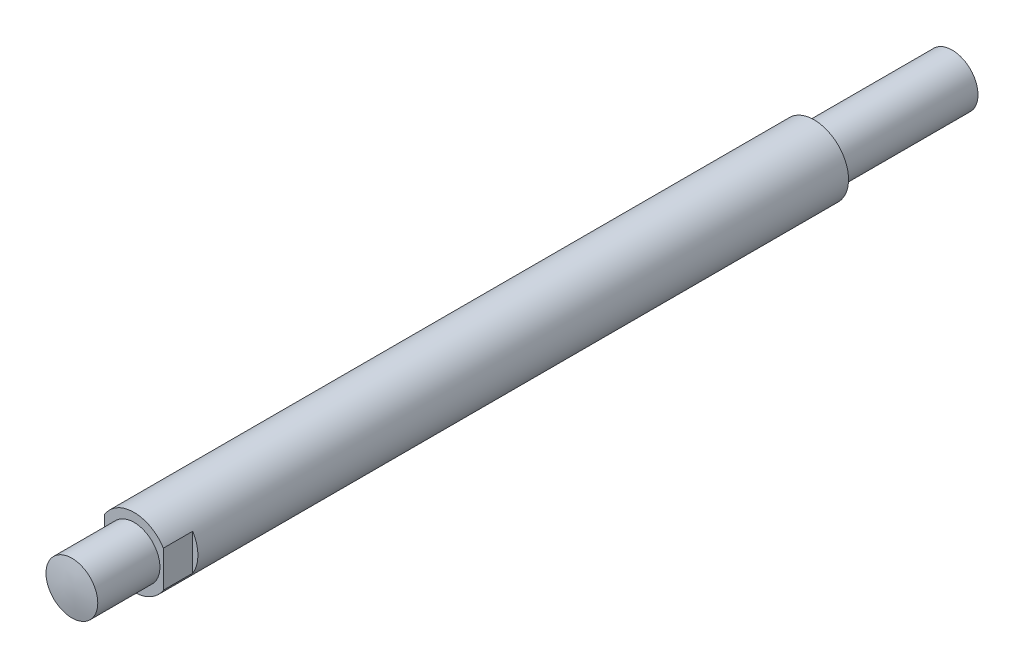
ISO-10303-21;
HEADER;
FILE_DESCRIPTION(('STEP AP214'),'2;1');
FILE_NAME('part.step','',(''),(''),'','','');
FILE_SCHEMA(('AUTOMOTIVE_DESIGN { 1 0 10303 214 1 1 1 1 }'));
ENDSEC;
DATA;
#1=APPLICATION_CONTEXT('core data for automotive mechanical design processes');
#2=APPLICATION_PROTOCOL_DEFINITION('international standard','automotive_design',2000,#1);
#3=PRODUCT_CONTEXT('',#1,'mechanical');
#4=PRODUCT('Part','Part','',(#3));
#5=PRODUCT_RELATED_PRODUCT_CATEGORY('part','',(#4));
#6=PRODUCT_DEFINITION_FORMATION('','',#4);
#7=PRODUCT_DEFINITION_CONTEXT('part definition',#1,'design');
#8=PRODUCT_DEFINITION('design','',#6,#7);
#9=PRODUCT_DEFINITION_SHAPE('','',#8);
#10=(LENGTH_UNIT() NAMED_UNIT(*) SI_UNIT(.MILLI.,.METRE.));
#11=(NAMED_UNIT(*) PLANE_ANGLE_UNIT() SI_UNIT($,.RADIAN.));
#12=(NAMED_UNIT(*) SI_UNIT($,.STERADIAN.) SOLID_ANGLE_UNIT());
#13=UNCERTAINTY_MEASURE_WITH_UNIT(LENGTH_MEASURE(1.E-05),#10,'distance_accuracy_value','');
#14=(GEOMETRIC_REPRESENTATION_CONTEXT(3) GLOBAL_UNCERTAINTY_ASSIGNED_CONTEXT((#13)) GLOBAL_UNIT_ASSIGNED_CONTEXT((#10,
#11,#12)) REPRESENTATION_CONTEXT('',''));
#15=CARTESIAN_POINT('',(0.,0.,0.));
#16=DIRECTION('',(0.,0.,1.));
#17=DIRECTION('',(1.,0.,0.));
#18=AXIS2_PLACEMENT_3D('',#15,#16,#17);
#19=CARTESIAN_POINT('',(0.,0.,255.));
#20=DIRECTION('',(0.,0.,-1.));
#21=DIRECTION('',(-1.,0.,0.));
#22=AXIS2_PLACEMENT_3D('',#19,#20,#21);
#23=CYLINDRICAL_SURFACE('',#22,20.);
#24=CARTESIAN_POINT('',(0.,0.,219.));
#25=DIRECTION('',(0.,0.,1.));
#26=DIRECTION('',(1.,0.,0.));
#27=AXIS2_PLACEMENT_3D('',#24,#25,#26);
#28=CIRCLE('',#27,20.);
#29=CARTESIAN_POINT('',(-17.,-10.5356537528527,219.));
#30=VERTEX_POINT('',#29);
#31=CARTESIAN_POINT('',(17.,-10.5356537528527,219.));
#32=VERTEX_POINT('',#31);
#33=EDGE_CURVE('E150',#30,#32,#28,.T.);
#34=ORIENTED_EDGE('',*,*,#33,.F.);
#35=DIRECTION('',(0.,0.,-1.));
#36=VECTOR('',#35,1.);
#37=CARTESIAN_POINT('',(-17.,-10.5356537528527,255.));
#38=LINE('',#37,#36);
#39=CARTESIAN_POINT('',(-17.,-10.5356537528527,202.));
#40=VERTEX_POINT('',#39);
#41=EDGE_CURVE('E110',#30,#40,#38,.T.);
#42=ORIENTED_EDGE('',*,*,#41,.T.);
#43=CARTESIAN_POINT('',(0.,0.,202.));
#44=DIRECTION('',(0.,0.,1.));
#45=DIRECTION('',(1.,0.,0.));
#46=AXIS2_PLACEMENT_3D('',#43,#44,#45);
#47=CIRCLE('',#46,20.);
#48=CARTESIAN_POINT('',(-17.,10.5356537528527,202.));
#49=VERTEX_POINT('',#48);
#50=EDGE_CURVE('E13',#49,#40,#47,.T.);
#51=ORIENTED_EDGE('',*,*,#50,.F.);
#52=DIRECTION('',(0.,0.,-1.));
#53=VECTOR('',#52,1.);
#54=CARTESIAN_POINT('',(-17.,10.5356537528527,255.));
#55=LINE('',#54,#53);
#56=CARTESIAN_POINT('',(-17.,10.5356537528527,219.));
#57=VERTEX_POINT('',#56);
#58=EDGE_CURVE('E225',#49,#57,#55,.F.);
#59=ORIENTED_EDGE('',*,*,#58,.T.);
#60=CARTESIAN_POINT('',(17.,10.5356537528527,219.));
#61=VERTEX_POINT('',#60);
#62=EDGE_CURVE('E144',#61,#57,#28,.T.);
#63=ORIENTED_EDGE('',*,*,#62,.F.);
#64=DIRECTION('',(0.,0.,-1.));
#65=VECTOR('',#64,1.);
#66=CARTESIAN_POINT('',(17.,10.5356537528527,255.));
#67=LINE('',#66,#65);
#68=CARTESIAN_POINT('',(17.,10.5356537528527,202.));
#69=VERTEX_POINT('',#68);
#70=EDGE_CURVE('E118',#61,#69,#67,.T.);
#71=ORIENTED_EDGE('',*,*,#70,.T.);
#72=CARTESIAN_POINT('',(0.,0.,202.));
#73=DIRECTION('',(0.,0.,-1.));
#74=DIRECTION('',(-1.,0.,0.));
#75=AXIS2_PLACEMENT_3D('',#72,#73,#74);
#76=CIRCLE('',#75,20.);
#77=CARTESIAN_POINT('',(17.,-10.5356537528527,202.));
#78=VERTEX_POINT('',#77);
#79=EDGE_CURVE('E102',#69,#78,#76,.T.);
#80=ORIENTED_EDGE('',*,*,#79,.T.);
#81=DIRECTION('',(0.,0.,-1.));
#82=VECTOR('',#81,1.);
#83=CARTESIAN_POINT('',(17.,-10.5356537528527,255.));
#84=LINE('',#83,#82);
#85=EDGE_CURVE('E137',#78,#32,#84,.F.);
#86=ORIENTED_EDGE('',*,*,#85,.T.);
#87=EDGE_LOOP('',(#34,#42,#51,#59,#63,#71,#80,#86));
#88=FACE_BOUND('',#87,.T.);
#89=CARTESIAN_POINT('',(0.,0.,-175.));
#90=DIRECTION('',(0.,0.,-1.));
#91=DIRECTION('',(-1.,0.,0.));
#92=AXIS2_PLACEMENT_3D('',#89,#90,#91);
#93=CIRCLE('',#92,20.);
#94=CARTESIAN_POINT('',(-20.,0.,-175.));
#95=VERTEX_POINT('',#94);
#96=EDGE_CURVE('E216',#95,#95,#93,.T.);
#97=ORIENTED_EDGE('',*,*,#96,.F.);
#98=EDGE_LOOP('',(#97));
#99=FACE_BOUND('',#98,.T.);
#100=ADVANCED_FACE('F86',(#88,#99),#23,.T.);
#101=CARTESIAN_POINT('',(0.,0.,219.));
#102=DIRECTION('',(0.,0.,1.));
#103=DIRECTION('',(1.,0.,0.));
#104=AXIS2_PLACEMENT_3D('',#101,#102,#103);
#105=PLANE('',#104);
#106=DIRECTION('',(0.,1.,0.));
#107=VECTOR('',#106,1.);
#108=CARTESIAN_POINT('',(-17.,0.,219.));
#109=LINE('',#108,#107);
#110=EDGE_CURVE('E143',#30,#57,#109,.T.);
#111=ORIENTED_EDGE('',*,*,#110,.F.);
#112=ORIENTED_EDGE('',*,*,#33,.T.);
#113=DIRECTION('',(0.,-1.,0.));
#114=VECTOR('',#113,1.);
#115=CARTESIAN_POINT('',(17.,0.,219.));
#116=LINE('',#115,#114);
#117=EDGE_CURVE('E134',#61,#32,#116,.T.);
#118=ORIENTED_EDGE('',*,*,#117,.F.);
#119=ORIENTED_EDGE('',*,*,#62,.T.);
#120=EDGE_LOOP('',(#111,#112,#118,#119));
#121=FACE_BOUND('',#120,.T.);
#122=CARTESIAN_POINT('',(0.,0.,219.));
#123=DIRECTION('',(0.,0.,1.));
#124=DIRECTION('',(1.,0.,0.));
#125=AXIS2_PLACEMENT_3D('',#122,#123,#124);
#126=CIRCLE('',#125,15.);
#127=CARTESIAN_POINT('',(15.,0.,219.));
#128=VERTEX_POINT('',#127);
#129=EDGE_CURVE('E155',#128,#128,#126,.T.);
#130=ORIENTED_EDGE('',*,*,#129,.F.);
#131=EDGE_LOOP('',(#130));
#132=FACE_BOUND('',#131,.T.);
#133=ADVANCED_FACE('F153',(#121,#132),#105,.T.);
#134=CARTESIAN_POINT('',(0.,0.,219.));
#135=DIRECTION('',(0.,0.,1.));
#136=DIRECTION('',(1.,0.,0.));
#137=AXIS2_PLACEMENT_3D('',#134,#135,#136);
#138=CYLINDRICAL_SURFACE('',#137,15.);
#139=ORIENTED_EDGE('',*,*,#129,.T.);
#140=EDGE_LOOP('',(#139));
#141=FACE_BOUND('',#140,.T.);
#142=CARTESIAN_POINT('',(-15.,1.70843807850707E-10,254.99951199867));
#143=CARTESIAN_POINT('',(-15.000003023886,-0.421429933077751,254.999511695906));
#144=CARTESIAN_POINT('',(-14.9822323795472,-0.84281024272008,254.999538330721));
#145=CARTESIAN_POINT('',(-14.9112738570485,-1.68271640968295,254.99963533552));
#146=CARTESIAN_POINT('',(-14.8580766613936,-2.10124148678927,254.999705717009));
#147=CARTESIAN_POINT('',(-14.7165537361749,-2.93276656729977,254.99986522376));
#148=CARTESIAN_POINT('',(-14.62819025014,-3.34576013754005,254.999954369121));
#149=CARTESIAN_POINT('',(-14.416965687494,-4.16282938104272,255.000120261735));
#150=CARTESIAN_POINT('',(-14.2941047356167,-4.56690508654408,255.000197009034));
#151=CARTESIAN_POINT('',(-14.0148271018533,-5.36306864258757,255.000314375227));
#152=CARTESIAN_POINT('',(-13.8584266955289,-5.7551622025943,255.000355011595));
#153=CARTESIAN_POINT('',(-13.5131445080155,-6.52478445239235,255.000394240263));
#154=CARTESIAN_POINT('',(-13.3242622138964,-6.90231291206705,255.000392831897));
#155=CARTESIAN_POINT('',(-12.9154133316155,-7.64001933821751,255.000362061304));
#156=CARTESIAN_POINT('',(-12.6954546779326,-8.00020170215501,255.000332706199));
#157=CARTESIAN_POINT('',(-12.2259811042841,-8.70075750840682,255.000272090878));
#158=CARTESIAN_POINT('',(-11.9764662999771,-9.04113102822893,255.000240830668));
#159=CARTESIAN_POINT('',(-11.4496251927713,-9.69968638658478,255.000198903026));
#160=CARTESIAN_POINT('',(-11.1722959397146,-10.0178658650115,255.00018823778));
#161=CARTESIAN_POINT('',(-10.591819305731,-10.6297317575441,255.00019196208));
#162=CARTESIAN_POINT('',(-10.2886718986075,-10.9234181467972,255.000206351652));
#163=CARTESIAN_POINT('',(-9.65870202855677,-11.48422058222,255.000242931489));
#164=CARTESIAN_POINT('',(-9.33187864462299,-11.7513355937905,255.000265122059));
#165=CARTESIAN_POINT('',(-8.65689092745192,-12.2570831230428,255.000290417611));
#166=CARTESIAN_POINT('',(-8.30872659844277,-12.4957156463676,255.000293522599));
#167=CARTESIAN_POINT('',(-7.59353885742734,-12.94279754468,255.000266287432));
#168=CARTESIAN_POINT('',(-7.22651579270748,-13.1512474752148,255.000235947895));
#169=CARTESIAN_POINT('',(-6.47621399758497,-13.5364874660318,255.000157350307));
#170=CARTESIAN_POINT('',(-6.09293526685449,-13.7132775256755,255.000109092256));
#171=CARTESIAN_POINT('',(-5.312847821182,-14.0339405717962,255.000032914722));
#172=CARTESIAN_POINT('',(-4.91603913360527,-14.1778136248456,255.000004995196));
#173=CARTESIAN_POINT('',(-4.11171210771302,-14.4316202654794,255.000000317273));
#174=CARTESIAN_POINT('',(-3.70419376940809,-14.5415538530973,255.000023558875));
#175=CARTESIAN_POINT('',(-2.88134388400207,-14.7267001743557,255.00007288952));
#176=CARTESIAN_POINT('',(-2.46601232241037,-14.8019128435952,255.000098978567));
#177=CARTESIAN_POINT('',(-1.63048948755435,-14.9170823096895,255.000147244564));
#178=CARTESIAN_POINT('',(-1.21029821429438,-14.9570391065758,255.000169421513));
#179=CARTESIAN_POINT('',(-0.368044028695934,-15.0014127186436,255.000193833377));
#180=CARTESIAN_POINT('',(0.0540188802652866,-15.0058295979286,255.000196068329));
#181=CARTESIAN_POINT('',(0.897016481001013,-14.9790921418663,255.000175088931));
#182=CARTESIAN_POINT('',(1.31795117277573,-14.9479378065255,255.000151874581));
#183=CARTESIAN_POINT('',(2.15569992412093,-14.8502793894248,255.00010217122));
#184=CARTESIAN_POINT('',(2.57251398199988,-14.7837752931543,255.000075682207));
#185=CARTESIAN_POINT('',(3.39905799495281,-14.6158901492291,255.000013402956));
#186=CARTESIAN_POINT('',(3.80878795003398,-14.51450910161,254.999977612719));
#187=CARTESIAN_POINT('',(4.61825125733565,-14.2775906863085,254.999951646363));
#188=CARTESIAN_POINT('',(5.01798459899007,-14.1420532825258,254.999961470292));
#189=CARTESIAN_POINT('',(5.8046123593436,-13.8377857998826,255.000016364755));
#190=CARTESIAN_POINT('',(6.19150677799926,-13.6690557209098,255.000061435288));
#191=CARTESIAN_POINT('',(6.94970596022682,-13.2996025284115,255.000147357787));
#192=CARTESIAN_POINT('',(7.32101072972818,-13.0988794270545,255.000188209754));
#193=CARTESIAN_POINT('',(8.04539101514694,-12.6668671644009,255.000240652124));
#194=CARTESIAN_POINT('',(8.39846653111842,-12.4355780031949,255.000252242526));
#195=CARTESIAN_POINT('',(9.08387801381458,-11.9440780487729,255.00024924856));
#196=CARTESIAN_POINT('',(9.4162139889289,-11.6838672672565,255.000234664202));
#197=CARTESIAN_POINT('',(10.0577838379247,-11.1363739374219,255.000201290982));
#198=CARTESIAN_POINT('',(10.3670177117839,-10.8490913890777,255.00018250212));
#199=CARTESIAN_POINT('',(10.9601849451089,-10.2494968772454,255.000161744329));
#200=CARTESIAN_POINT('',(11.2441183000753,-9.93718490930613,255.000159775404));
#201=CARTESIAN_POINT('',(11.7846658377082,-9.28975195373501,255.000177911067));
#202=CARTESIAN_POINT('',(12.0412800203587,-8.9546309660897,255.000198015656));
#203=CARTESIAN_POINT('',(12.5253648718041,-8.26396243588053,255.000247818182));
#204=CARTESIAN_POINT('',(12.7528355368593,-7.90841489069549,255.000277516119));
#205=CARTESIAN_POINT('',(13.1770161350856,-7.17942101346713,255.000325673245));
#206=CARTESIAN_POINT('',(13.3737260682834,-6.80597468143932,255.000344132433));
#207=CARTESIAN_POINT('',(13.7349867147422,-6.04383820620328,255.000353791086));
#208=CARTESIAN_POINT('',(13.8995374276885,-5.65514806284584,255.000344990549));
#209=CARTESIAN_POINT('',(14.1953097736463,-4.86528732423066,255.00029799418));
#210=CARTESIAN_POINT('',(14.3265314066299,-4.46411672896248,255.000259798347));
#211=CARTESIAN_POINT('',(14.5547126805047,-3.65214718858944,255.000166737567));
#212=CARTESIAN_POINT('',(14.6516723229777,-3.24134824392913,255.000111872621));
#213=CARTESIAN_POINT('',(14.8106403002141,-2.41304251841803,255.000006728878));
#214=CARTESIAN_POINT('',(14.8726486349899,-1.99553573756964,254.999956450082));
#215=CARTESIAN_POINT('',(14.9612731529365,-1.15678257628891,254.999880518096));
#216=CARTESIAN_POINT('',(14.9878893374546,-0.735536195998918,254.999854864906));
#217=CARTESIAN_POINT('',(15.0055403335597,0.107701369061346,254.999838365336));
#218=CARTESIAN_POINT('',(14.9965751451684,0.52969255383117,254.999847518956));
#219=CARTESIAN_POINT('',(14.9431271316189,1.37141964100034,254.999896753571));
#220=CARTESIAN_POINT('',(14.8986443048013,1.79115554329431,254.999936834568));
#221=CARTESIAN_POINT('',(14.7744772590352,2.62538797599541,255.000031653922));
#222=CARTESIAN_POINT('',(14.6947930400363,3.03988450639505,255.000086392278));
#223=CARTESIAN_POINT('',(14.5007897259349,3.86069133590422,255.000188815008));
#224=CARTESIAN_POINT('',(14.3864706342011,4.26700163580998,255.00023649938));
#225=CARTESIAN_POINT('',(14.1240103113295,5.06854742434355,255.000307332172));
#226=CARTESIAN_POINT('',(13.9758690802569,5.46378291299268,255.000330480591));
#227=CARTESIAN_POINT('',(13.6468176955744,6.24036914020265,255.000347276533));
#228=CARTESIAN_POINT('',(13.4659075462708,6.6217198805881,255.000340924058));
#229=CARTESIAN_POINT('',(13.0726044746099,7.36782549149494,255.000308824799));
#230=CARTESIAN_POINT('',(12.860211552204,7.73258036199075,255.000283078013));
#231=CARTESIAN_POINT('',(12.4054529368515,8.44290101960906,255.000231835114));
#232=CARTESIAN_POINT('',(12.163087246154,8.78846680817148,255.000206339002));
#233=CARTESIAN_POINT('',(11.6501061550034,9.45795256766973,255.000172965544));
#234=CARTESIAN_POINT('',(11.3794907545836,9.78187253863101,255.000165088198));
#235=CARTESIAN_POINT('',(10.8119340411511,10.4057639137933,255.000170252145));
#236=CARTESIAN_POINT('',(10.5149927174637,10.7057353082836,255.000183293445));
#237=CARTESIAN_POINT('',(9.89689532628494,11.279596767659,255.000215807292));
#238=CARTESIAN_POINT('',(9.57573925876093,11.553486832509,255.000235279838));
#239=CARTESIAN_POINT('',(8.91149546104918,12.0732385524158,255.000257468459));
#240=CARTESIAN_POINT('',(8.5684077212462,12.3191001951843,255.000260184528));
#241=CARTESIAN_POINT('',(7.86273985727837,12.781047000654,255.000235229725));
#242=CARTESIAN_POINT('',(7.50015973311108,12.9971321633514,255.000207558854));
#243=CARTESIAN_POINT('',(6.75808522450336,13.3979895588279,255.000133915021));
#244=CARTESIAN_POINT('',(6.37859085794532,13.5827618247111,255.000087942078));
#245=CARTESIAN_POINT('',(5.60538547981107,13.9196800875281,255.000011449195));
#246=CARTESIAN_POINT('',(5.21167446829187,14.0718260845927,254.999980929255));
#247=CARTESIAN_POINT('',(4.41283500905457,14.3424100888551,254.999969575834));
#248=CARTESIAN_POINT('',(4.00770656598136,14.4608481097659,254.999988742334));
#249=CARTESIAN_POINT('',(3.18891230557251,14.6631742226248,255.000038832071));
#250=CARTESIAN_POINT('',(2.77524648820087,14.7470623144273,255.000069755309));
#251=CARTESIAN_POINT('',(1.94231763695636,14.8796922956381,255.000121496667));
#252=CARTESIAN_POINT('',(1.52305459298687,14.9284341216389,255.000142314769));
#253=CARTESIAN_POINT('',(0.681912735128423,14.9904247984794,255.000173837015));
#254=CARTESIAN_POINT('',(0.260033921242188,15.0036736493563,255.00018454116));
#255=CARTESIAN_POINT('',(-0.583339368634766,14.9945841931866,255.00018252332));
#256=CARTESIAN_POINT('',(-1.00483384534987,14.9722459533529,255.000169801379));
#257=CARTESIAN_POINT('',(-1.84444269325253,14.8921412529263,255.000139262928));
#258=CARTESIAN_POINT('',(-2.26255706443167,14.8343747922452,255.000121446417));
#259=CARTESIAN_POINT('',(-3.09243400470308,14.6838241814301,255.000073420644));
#260=CARTESIAN_POINT('',(-3.50419656093743,14.5910399604195,255.000043211357));
#261=CARTESIAN_POINT('',(-4.31844160561687,14.3711134836041,255.000014112925));
#262=CARTESIAN_POINT('',(-4.72092409425579,14.2439712285168,255.00001522378));
#263=CARTESIAN_POINT('',(-5.51375495564886,13.9562299187357,255.000058016251));
#264=CARTESIAN_POINT('',(-5.90410310316618,13.7956302434332,255.000099698618));
#265=CARTESIAN_POINT('',(-6.66988230149598,13.4421172963936,255.000183493178));
#266=CARTESIAN_POINT('',(-7.04531334937368,13.2492040182993,255.000225605371));
#267=CARTESIAN_POINT('',(-7.77857478759922,12.8324435619971,255.000281684392));
#268=CARTESIAN_POINT('',(-8.13640586238962,12.6085975880176,255.000295652315));
#269=CARTESIAN_POINT('',(-8.8319387994861,12.1315576143209,255.000294970658));
#270=CARTESIAN_POINT('',(-9.16964068216326,11.8783636443051,255.000280321106));
#271=CARTESIAN_POINT('',(-9.82248013859714,11.344455881576,255.000244622355));
#272=CARTESIAN_POINT('',(-10.1376201063286,11.0637450161058,255.000223573836));
#273=CARTESIAN_POINT('',(-10.7431365304801,10.4767749932713,255.000198823064));
#274=CARTESIAN_POINT('',(-11.0335128900601,10.1705157360072,255.000195120878));
#275=CARTESIAN_POINT('',(-11.5875075089749,9.53454544425415,255.000212315318));
#276=CARTESIAN_POINT('',(-11.8511189280405,9.20482845114579,255.000233218215));
#277=CARTESIAN_POINT('',(-12.3496206804517,8.52436223545847,255.000285816796));
#278=CARTESIAN_POINT('',(-12.5845114672088,8.17361334503955,255.000317512311));
#279=CARTESIAN_POINT('',(-13.0240131101121,7.45339753396478,255.000366245775));
#280=CARTESIAN_POINT('',(-13.2286092425941,7.08392162802344,255.000383276617));
#281=CARTESIAN_POINT('',(-13.6059296949614,6.32903926839558,255.000381254861));
#282=CARTESIAN_POINT('',(-13.778653899671,5.94363275714667,255.000362202133));
#283=CARTESIAN_POINT('',(-14.0908330269705,5.16004675404105,255.000283299585));
#284=CARTESIAN_POINT('',(-14.230323527454,4.76188144390697,255.00022349366));
#285=CARTESIAN_POINT('',(-14.4752480442522,3.95535210413071,255.000078145372));
#286=CARTESIAN_POINT('',(-14.5806910090804,3.54699078469265,254.999992609783));
#287=CARTESIAN_POINT('',(-14.7787527870342,2.62018149023527,254.99980326877));
#288=CARTESIAN_POINT('',(-14.8616500812691,2.09962752706959,254.999700214));
#289=CARTESIAN_POINT('',(-14.9722717992118,1.05268991084276,254.999554768006));
#290=CARTESIAN_POINT('',(-14.999996223595,0.526306257852966,254.99951237678));
#291=CARTESIAN_POINT('',(-15.,1.70843807850707E-10,254.99951199867));
#292=B_SPLINE_CURVE_WITH_KNOTS('',3,(#142,#143,#144,#145,#146,#147,#148,#149,#150,#151,#152,
#153,#154,#155,#156,#157,#158,#159,#160,#161,#162,#163,#164,#165,#166,#167,#168,#169,#170,#171,
#172,#173,#174,#175,#176,#177,#178,#179,#180,#181,#182,#183,#184,#185,#186,#187,#188,#189,#190,
#191,#192,#193,#194,#195,#196,#197,#198,#199,#200,#201,#202,#203,#204,#205,#206,#207,#208,#209,
#210,#211,#212,#213,#214,#215,#216,#217,#218,#219,#220,#221,#222,#223,#224,#225,#226,#227,#228,
#229,#230,#231,#232,#233,#234,#235,#236,#237,#238,#239,#240,#241,#242,#243,#244,#245,#246,#247,
#248,#249,#250,#251,#252,#253,#254,#255,#256,#257,#258,#259,#260,#261,#262,#263,#264,#265,#266,
#267,#268,#269,#270,#271,#272,#273,#274,#275,#276,#277,#278,#279,#280,#281,#282,#283,#284,#285,
#286,#287,#288,#289,#290,#291),.UNSPECIFIED.,.T.,.F.,(4,2,2,2,2,2,2,2,2,2,2,2,2,2,2,2,2,2,2,2,2,
2,2,2,2,2,2,2,2,2,2,2,2,2,2,2,2,2,2,2,2,2,2,2,2,2,2,2,2,2,2,2,2,2,2,2,2,2,2,2,2,2,2,2,2,2,2,2,2,
2,2,2,2,2,4),(0.,1.26383007157975,2.52799267295286,3.79351622667909,5.05903520466168,
6.32394145320634,7.58886767805431,8.853471521086,10.118070415659,11.3828035828934,
12.647538033421,13.9123217091521,15.1771051342998,16.4418652766146,17.7066254444365,
18.9713830543445,20.236140663002,21.5009006175427,22.7656605709504,24.0304182430997,
25.295175915017,26.5599341060996,27.8246922958965,29.0894518224417,30.3542113532677,
31.6189704030435,32.8837294490673,34.1484879834627,35.4132465190758,36.6780052796079,
37.9427640408854,39.2075229644594,40.4722818869378,41.7370408217964,43.0017997577123,
44.2665586352348,45.5313175123044,46.7960763412229,48.0608351693725,49.3255940566113,
50.5903529456558,51.8551117116834,53.1198704752766,54.3846290726657,55.649387672003,
56.9141461764334,58.1789046793773,59.4436636951567,60.7084227126422,61.9731822846256,
63.2379418567683,64.5027000917908,65.767458321742,67.0322160371684,68.2969737579285,
69.5617337604415,70.8264937616335,72.0912513740943,73.3560089897014,74.62076916521,
75.8855293143012,77.1503129257833,78.4150967860961,79.6798314214771,80.9445647769035,
82.2091637358991,83.4737676399869,84.7386939274515,86.0036002429952,87.2691193185632,
88.5346429672568,89.7988056771809,91.0626358637053,92.6409805207488,94.2193251584727),.UNSPECIFIED.);
#293=CARTESIAN_POINT('',(-15.,1.70843807850707E-10,254.99951199867));
#294=VERTEX_POINT('',#293);
#295=EDGE_CURVE('E93',#294,#294,#292,.T.);
#296=ORIENTED_EDGE('',*,*,#295,.F.);
#297=EDGE_LOOP('',(#296));
#298=FACE_BOUND('',#297,.T.);
#299=ADVANCED_FACE('F187',(#141,#298),#138,.T.);
#300=CARTESIAN_POINT('',(-15.4640384320633,15.5059468598414,253.629309145925));
#301=CARTESIAN_POINT('',(-15.4640384320632,9.32761405928344,254.51099503476));
#302=CARTESIAN_POINT('',(-15.4640384320632,3.1492812587255,255.229750574048));
#303=CARTESIAN_POINT('',(-15.4640384320631,-3.02905154183244,255.244036529074));
#304=CARTESIAN_POINT('',(-15.464038432063,-9.20738434239037,254.526292331005));
#305=CARTESIAN_POINT('',(-15.4640384320629,-15.3857171429483,253.62213644872));
#306=CARTESIAN_POINT('',(-12.9904789911699,15.5059468598414,253.945304292979));
#307=CARTESIAN_POINT('',(-12.9904789911699,9.32761405928347,254.92589201859));
#308=CARTESIAN_POINT('',(-12.9904789911698,3.14928125872554,255.736557432401));
#309=CARTESIAN_POINT('',(-12.9904789911697,-3.0290515418324,255.755031958579));
#310=CARTESIAN_POINT('',(-12.9904789911696,-9.20738434239035,254.947815089452));
#311=CARTESIAN_POINT('',(-12.9904789911695,-15.3857171429483,253.946498737537));
#312=CARTESIAN_POINT('',(-10.5169195502765,15.5059468598414,254.238130235241));
#313=CARTESIAN_POINT('',(-10.5169195502764,9.3276140592835,255.318544999336));
#314=CARTESIAN_POINT('',(-10.5169195502764,3.14928125872557,256.234067640084));
#315=CARTESIAN_POINT('',(-10.5169195502763,-3.02905154183237,256.256827811726));
#316=CARTESIAN_POINT('',(-10.5169195502762,-9.20738434239032,255.346771926231));
#317=CARTESIAN_POINT('',(-10.5169195502761,-15.3857171429483,254.247136646877));
#318=CARTESIAN_POINT('',(-8.04336010938312,15.5059468598415,254.512888986377));
#319=CARTESIAN_POINT('',(-8.04336010938304,9.32761405928354,255.712331004913));
#320=CARTESIAN_POINT('',(-8.04336010938296,3.14928125872559,256.736724144427));
#321=CARTESIAN_POINT('',(-8.04336010938289,-3.02905154183234,256.762484026922));
#322=CARTESIAN_POINT('',(-8.04336010938281,-9.20738434239029,255.747349046623));
#323=CARTESIAN_POINT('',(-8.04336010938273,-15.3857171429482,254.529100144636));
#324=CARTESIAN_POINT('',(-4.32805450020312,15.5059468598415,254.81990203503));
#325=CARTESIAN_POINT('',(-4.32805450020304,9.32761405928359,256.149578607559));
#326=CARTESIAN_POINT('',(-4.32805450020296,3.14928125872565,257.389213218421));
#327=CARTESIAN_POINT('',(-4.32805450020289,-3.0290515418323,257.421965097006));
#328=CARTESIAN_POINT('',(-4.32805450020281,-9.20738434239024,256.191751110748));
#329=CARTESIAN_POINT('',(-4.32805450020273,-15.3857171429482,254.843542994529));
#330=CARTESIAN_POINT('',(-0.61274889102312,15.5059468598416,254.903345640193));
#331=CARTESIAN_POINT('',(-0.612748891023043,9.32761405928363,256.262731348378));
#332=CARTESIAN_POINT('',(-0.612748891022966,3.14928125872569,257.59206701723));
#333=CARTESIAN_POINT('',(-0.61274889102289,-3.02905154183225,257.627955480817));
#334=CARTESIAN_POINT('',(-0.612748891022813,-9.20738434239019,256.306790277624));
#335=CARTESIAN_POINT('',(-0.612748891022737,-15.3857171429481,254.928830292268));
#336=CARTESIAN_POINT('',(0.628997277263474,15.5059468598416,254.903203908478));
#337=CARTESIAN_POINT('',(0.62899727726355,9.32761405928365,256.262193160732));
#338=CARTESIAN_POINT('',(0.628997277263627,3.14928125872571,257.591034499947));
#339=CARTESIAN_POINT('',(0.628997277263703,-3.02905154183223,257.626906614414));
#340=CARTESIAN_POINT('',(0.628997277263779,-9.20738434239017,256.306238722541));
#341=CARTESIAN_POINT('',(0.628997277263856,-15.3857171429481,254.928678373023));
#342=CARTESIAN_POINT('',(4.35423578212325,15.5059468598416,254.818831310514));
#343=CARTESIAN_POINT('',(4.35423578212333,9.32761405928369,256.145564363805));
#344=CARTESIAN_POINT('',(4.35423578212341,3.14928125872576,257.381929387696));
#345=CARTESIAN_POINT('',(4.35423578212348,-3.02905154183219,257.414589105427));
#346=CARTESIAN_POINT('',(4.35423578212356,-9.20738434239012,256.187634941754));
#347=CARTESIAN_POINT('',(4.35423578212363,-15.3857171429481,254.84239612895));
#348=CARTESIAN_POINT('',(8.07947428698303,15.5059468598417,254.510894086512));
#349=CARTESIAN_POINT('',(8.07947428698311,9.32761405928374,255.704025185309));
#350=CARTESIAN_POINT('',(8.07947428698319,3.14928125872579,256.723209346806));
#351=CARTESIAN_POINT('',(8.07947428698326,-3.02905154183214,256.748879280144));
#352=CARTESIAN_POINT('',(8.07947428698334,-9.20738434239008,255.738819369655));
#353=CARTESIAN_POINT('',(8.07947428698341,-15.385717142948,254.526952298068));
#354=CARTESIAN_POINT('',(10.5629666235562,15.5059468598417,254.235989539962));
#355=CARTESIAN_POINT('',(10.5629666235563,9.32761405928377,255.309609288702));
#356=CARTESIAN_POINT('',(10.5629666235564,3.14928125872583,256.216387322168));
#357=CARTESIAN_POINT('',(10.5629666235564,-3.02905154183211,256.238878317416));
#358=CARTESIAN_POINT('',(10.5629666235565,-9.20738434239005,255.337605670433));
#359=CARTESIAN_POINT('',(10.5629666235566,-15.385717142948,254.244795613355));
#360=CARTESIAN_POINT('',(13.0464589601294,15.5059468598417,253.945010376978));
#361=CARTESIAN_POINT('',(13.0464589601295,9.3276140592838,254.917101195243));
#362=CARTESIAN_POINT('',(13.0464589601296,3.14928125872587,255.718709866976));
#363=CARTESIAN_POINT('',(13.0464589601296,-3.02905154183208,255.736911034151));
#364=CARTESIAN_POINT('',(13.0464589601297,-9.20738434239002,254.938754929083));
#365=CARTESIAN_POINT('',(13.0464589601298,-15.385717142948,253.945988154039));
#366=CARTESIAN_POINT('',(15.5299512967026,15.5059468598418,253.632390759268));
#367=CARTESIAN_POINT('',(15.5299512967027,9.32761405928384,254.503493055838));
#368=CARTESIAN_POINT('',(15.5299512967027,3.1492812587259,255.21555136032));
#369=CARTESIAN_POINT('',(15.5299512967028,-3.02905154183205,255.229676173746));
#370=CARTESIAN_POINT('',(15.5299512967029,-9.20738434238999,254.518488877026));
#371=CARTESIAN_POINT('',(15.529951296703,-15.3857171429479,253.624995722161));
#372=B_SPLINE_SURFACE_WITH_KNOTS('',5,5,((#300,#301,#302,#303,#304,#305),(#306,#307,#308,#309,
#310,#311),(#312,#313,#314,#315,#316,#317),(#318,#319,#320,#321,#322,#323),(#324,#325,#326,#327,
#328,#329),(#330,#331,#332,#333,#334,#335),(#336,#337,#338,#339,#340,#341),(#342,#343,#344,#345,
#346,#347),(#348,#349,#350,#351,#352,#353),(#354,#355,#356,#357,#358,#359),(#360,#361,#362,#363,
#364,#365),(#366,#367,#368,#369,#370,#371)),.UNSPECIFIED.,.F.,.F.,.F.,(6,3,3,6),(6,6),
(-16.1783241465932,-3.81052694212619,2.39820389930678,14.8156655821727),(-15.5059468598416,
15.3857171429481),.UNSPECIFIED.);
#373=ORIENTED_EDGE('',*,*,#295,.T.);
#374=EDGE_LOOP('',(#373));
#375=FACE_BOUND('',#374,.T.);
#376=ADVANCED_FACE('F88',(#375),#372,.F.);
#377=CARTESIAN_POINT('',(0.,0.,202.));
#378=DIRECTION('',(0.,0.,-1.));
#379=DIRECTION('',(-1.,0.,0.));
#380=AXIS2_PLACEMENT_3D('',#377,#378,#379);
#381=PLANE('',#380);
#382=DIRECTION('',(0.,-1.,0.));
#383=VECTOR('',#382,1.);
#384=CARTESIAN_POINT('',(17.,19.5232728597712,202.));
#385=LINE('',#384,#383);
#386=EDGE_CURVE('E217',#69,#78,#385,.T.);
#387=ORIENTED_EDGE('',*,*,#386,.T.);
#388=ORIENTED_EDGE('',*,*,#79,.F.);
#389=EDGE_LOOP('',(#387,#388));
#390=FACE_BOUND('',#389,.T.);
#391=ADVANCED_FACE('F195',(#390),#381,.F.);
#392=CARTESIAN_POINT('',(17.,19.5232728597712,202.));
#393=DIRECTION('',(-1.,0.,0.));
#394=DIRECTION('',(0.,-1.,0.));
#395=AXIS2_PLACEMENT_3D('',#392,#393,#394);
#396=PLANE('',#395);
#397=ORIENTED_EDGE('',*,*,#117,.T.);
#398=ORIENTED_EDGE('',*,*,#85,.F.);
#399=ORIENTED_EDGE('',*,*,#386,.F.);
#400=ORIENTED_EDGE('',*,*,#70,.F.);
#401=EDGE_LOOP('',(#397,#398,#399,#400));
#402=FACE_BOUND('',#401,.T.);
#403=ADVANCED_FACE('F136',(#402),#396,.F.);
#404=CARTESIAN_POINT('',(0.,0.,202.));
#405=DIRECTION('',(0.,0.,1.));
#406=DIRECTION('',(1.,0.,0.));
#407=AXIS2_PLACEMENT_3D('',#404,#405,#406);
#408=PLANE('',#407);
#409=ORIENTED_EDGE('',*,*,#50,.T.);
#410=DIRECTION('',(0.,1.,0.));
#411=VECTOR('',#410,1.);
#412=CARTESIAN_POINT('',(-17.,18.1296924401513,202.));
#413=LINE('',#412,#411);
#414=EDGE_CURVE('E151',#40,#49,#413,.T.);
#415=ORIENTED_EDGE('',*,*,#414,.T.);
#416=EDGE_LOOP('',(#409,#415));
#417=FACE_BOUND('',#416,.T.);
#418=ADVANCED_FACE('F194',(#417),#408,.T.);
#419=CARTESIAN_POINT('',(-17.,18.1296924401513,202.));
#420=DIRECTION('',(1.,0.,0.));
#421=DIRECTION('',(0.,1.,0.));
#422=AXIS2_PLACEMENT_3D('',#419,#420,#421);
#423=PLANE('',#422);
#424=ORIENTED_EDGE('',*,*,#110,.T.);
#425=ORIENTED_EDGE('',*,*,#58,.F.);
#426=ORIENTED_EDGE('',*,*,#414,.F.);
#427=ORIENTED_EDGE('',*,*,#41,.F.);
#428=EDGE_LOOP('',(#424,#425,#426,#427));
#429=FACE_BOUND('',#428,.T.);
#430=ADVANCED_FACE('F199',(#429),#423,.F.);
#431=CARTESIAN_POINT('',(0.,0.,-175.));
#432=DIRECTION('',(0.,0.,-1.));
#433=DIRECTION('',(-1.,0.,0.));
#434=AXIS2_PLACEMENT_3D('',#431,#432,#433);
#435=PLANE('',#434);
#436=CARTESIAN_POINT('',(0.,0.,-175.));
#437=DIRECTION('',(0.,0.,-1.));
#438=DIRECTION('',(-1.,0.,0.));
#439=AXIS2_PLACEMENT_3D('',#436,#437,#438);
#440=CIRCLE('',#439,15.);
#441=CARTESIAN_POINT('',(-15.,0.,-175.));
#442=VERTEX_POINT('',#441);
#443=EDGE_CURVE('E168',#442,#442,#440,.T.);
#444=ORIENTED_EDGE('',*,*,#443,.F.);
#445=EDGE_LOOP('',(#444));
#446=FACE_BOUND('',#445,.T.);
#447=ORIENTED_EDGE('',*,*,#96,.T.);
#448=EDGE_LOOP('',(#447));
#449=FACE_BOUND('',#448,.T.);
#450=ADVANCED_FACE('F202',(#446,#449),#435,.T.);
#451=CARTESIAN_POINT('',(0.,0.,-175.));
#452=DIRECTION('',(0.,0.,-1.));
#453=DIRECTION('',(-1.,0.,0.));
#454=AXIS2_PLACEMENT_3D('',#451,#452,#453);
#455=CYLINDRICAL_SURFACE('',#454,15.);
#456=ORIENTED_EDGE('',*,*,#443,.T.);
#457=EDGE_LOOP('',(#456));
#458=FACE_BOUND('',#457,.T.);
#459=CARTESIAN_POINT('',(15.,1.70846626776355E-10,-254.999511998603));
#460=CARTESIAN_POINT('',(15.000003023886,-0.421429933077599,-254.999511695835));
#461=CARTESIAN_POINT('',(14.9822323795472,-0.842810242719774,-254.999538330702));
#462=CARTESIAN_POINT('',(14.9112738570486,-1.68271640968233,-254.999635335674));
#463=CARTESIAN_POINT('',(14.8580766613937,-2.10124148678848,-254.999705717284));
#464=CARTESIAN_POINT('',(14.7165537361751,-2.93276656729865,-254.999865224263));
#465=CARTESIAN_POINT('',(14.6281902501403,-3.34576013753875,-254.999954369729));
#466=CARTESIAN_POINT('',(14.4169656874944,-4.1628293810411,-255.000120262453));
#467=CARTESIAN_POINT('',(14.2941047356173,-4.56690508654233,-255.000197009755));
#468=CARTESIAN_POINT('',(14.0148271018541,-5.36306864258555,-255.000314375824));
#469=CARTESIAN_POINT('',(13.8584266955298,-5.75516220259215,-255.000355012065));
#470=CARTESIAN_POINT('',(13.5131445080167,-6.52478445238996,-255.000394240399));
#471=CARTESIAN_POINT('',(13.3242622138977,-6.90231291206455,-255.000392831827));
#472=CARTESIAN_POINT('',(12.9154133316171,-7.64001933821481,-255.000362060857));
#473=CARTESIAN_POINT('',(12.6954546779344,-8.00020170215222,-255.000332705583));
#474=CARTESIAN_POINT('',(12.2259811042862,-8.70075750840388,-255.00027209008));
#475=CARTESIAN_POINT('',(11.9764662999793,-9.04113102822592,-255.000240829858));
#476=CARTESIAN_POINT('',(11.4496251927738,-9.69968638658181,-255.000198902413));
#477=CARTESIAN_POINT('',(11.1722959397171,-10.0178658650086,-255.000188237376));
#478=CARTESIAN_POINT('',(10.5918193057337,-10.6297317575414,-255.000191962264));
#479=CARTESIAN_POINT('',(10.2886718986103,-10.9234181467946,-255.000206352215));
#480=CARTESIAN_POINT('',(9.65870202855962,-11.4842205822176,-255.00024293279));
#481=CARTESIAN_POINT('',(9.33187864462589,-11.7513355937882,-255.000265123718));
#482=CARTESIAN_POINT('',(8.65689092745492,-12.2570831230407,-255.000290419671));
#483=CARTESIAN_POINT('',(8.30872659844582,-12.4957156463655,-255.000293524699));
#484=CARTESIAN_POINT('',(7.59353885743096,-12.9427975446778,-255.000266288964));
#485=CARTESIAN_POINT('',(7.22651579271163,-13.1512474752125,-255.000235948817));
#486=CARTESIAN_POINT('',(6.47621399759029,-13.5364874660292,-255.000157349256));
#487=CARTESIAN_POINT('',(6.09293526686044,-13.7132775256728,-255.00010908984));
#488=CARTESIAN_POINT('',(5.31284782118918,-14.0339405717935,-255.000032909109));
#489=CARTESIAN_POINT('',(4.91603913361305,-14.1778136248429,-255.000004987751));
#490=CARTESIAN_POINT('',(4.11171210772188,-14.4316202654768,-255.000000307634));
#491=CARTESIAN_POINT('',(3.70419376941743,-14.5415538530949,-255.000023548875));
#492=CARTESIAN_POINT('',(2.88134388401691,-14.7267001743526,-255.000072881976));
#493=CARTESIAN_POINT('',(2.4660123224303,-14.8019128435917,-255.000098973841));
#494=CARTESIAN_POINT('',(1.63048948758437,-14.917082309686,-255.000147243324));
#495=CARTESIAN_POINT('',(1.2102982143294,-14.9570391065729,-255.000169420941));
#496=CARTESIAN_POINT('',(0.368044028740847,-15.0014127186423,-255.000193833556));
#497=CARTESIAN_POINT('',(-0.0540188802154679,-15.0058295979286,-255.00019606859));
#498=CARTESIAN_POINT('',(-0.897016480941577,-14.9790921418697,-255.000175089482));
#499=CARTESIAN_POINT('',(-1.31795117271158,-14.947937806531,-255.000151875341));
#500=CARTESIAN_POINT('',(-2.15569992405162,-14.8502793894348,-255.000102173727));
#501=CARTESIAN_POINT('',(-2.57251398193009,-14.7837752931664,-255.000075686253));
#502=CARTESIAN_POINT('',(-3.39905799488222,-14.6158901492455,-255.000013409284));
#503=CARTESIAN_POINT('',(-3.80878794996308,-14.5145091016286,-254.99997761979));
#504=CARTESIAN_POINT('',(-4.61825125726433,-14.2775906863315,-254.999951652854));
#505=CARTESIAN_POINT('',(-5.01798459891865,-14.1420532825511,-254.999961475461));
#506=CARTESIAN_POINT('',(-5.80461235927224,-13.8377857999125,-255.000016367543));
#507=CARTESIAN_POINT('',(-6.19150677792806,-13.669055720942,-255.000061437019));
#508=CARTESIAN_POINT('',(-6.9497059601589,-13.299602528447,-255.00014735786));
#509=CARTESIAN_POINT('',(-7.32101072966326,-13.0988794270909,-255.000188209227));
#510=CARTESIAN_POINT('',(-8.04539101508796,-12.6668671644385,-255.000240650915));
#511=CARTESIAN_POINT('',(-8.39846653106237,-12.4355780032329,-255.000252241237));
#512=CARTESIAN_POINT('',(-9.08387801376431,-11.9440780488112,-255.000249247408));
#513=CARTESIAN_POINT('',(-9.41621398888148,-11.6838672672948,-255.000234663268));
#514=CARTESIAN_POINT('',(-10.0577838378828,-11.1363739374598,-255.000201290555));
#515=CARTESIAN_POINT('',(-10.3670177117447,-10.8490913891152,-255.000182501982));
#516=CARTESIAN_POINT('',(-10.9601849450744,-10.2494968772823,-255.000161744674));
#517=CARTESIAN_POINT('',(-11.2441183000428,-9.93718490934292,-255.000159775943));
#518=CARTESIAN_POINT('',(-11.7846658376797,-9.28975195377128,-255.000177911835));
#519=CARTESIAN_POINT('',(-12.041280020332,-8.9546309661256,-255.000198016458));
#520=CARTESIAN_POINT('',(-12.5253648717811,-8.26396243591543,-255.00024781892));
#521=CARTESIAN_POINT('',(-12.7528355368381,-7.90841489072978,-255.000277516759));
#522=CARTESIAN_POINT('',(-13.1770161350677,-7.17942101349999,-255.000325673635));
#523=CARTESIAN_POINT('',(-13.3737260682671,-6.80597468147137,-255.000344132672));
#524=CARTESIAN_POINT('',(-13.7349867147284,-6.04383820623467,-255.000353791054));
#525=CARTESIAN_POINT('',(-13.8995374276757,-5.65514806287743,-255.000344990399));
#526=CARTESIAN_POINT('',(-14.1953097736353,-4.86528732426256,-255.000297993874));
#527=CARTESIAN_POINT('',(-14.3265314066199,-4.46411672899449,-255.000259798004));
#528=CARTESIAN_POINT('',(-14.5547126804966,-3.65214718862158,-255.000166737227));
#529=CARTESIAN_POINT('',(-14.6516723229706,-3.24134824396127,-255.00011187232));
#530=CARTESIAN_POINT('',(-14.8106403002088,-2.41304251845012,-255.000006728687));
#531=CARTESIAN_POINT('',(-14.8726486349856,-1.99553573760166,-254.999956449961));
#532=CARTESIAN_POINT('',(-14.961273152934,-1.1567825763207,-254.999880518088));
#533=CARTESIAN_POINT('',(-14.9878893374531,-0.735536196030555,-254.999854864941));
#534=CARTESIAN_POINT('',(-15.00554033356,0.107701369030092,-254.999838365396));
#535=CARTESIAN_POINT('',(-14.9965751451695,0.529692553800145,-254.999847518999));
#536=CARTESIAN_POINT('',(-14.9431271316217,1.37141964096985,-254.999896753532));
#537=CARTESIAN_POINT('',(-14.898644304805,1.79115554326413,-254.999936834465));
#538=CARTESIAN_POINT('',(-14.7744772590404,2.62538797596592,-255.00003165369));
#539=CARTESIAN_POINT('',(-14.6947930400424,3.03988450636594,-255.000086391984));
#540=CARTESIAN_POINT('',(-14.5007897259425,3.86069133587589,-255.000188814644));
#541=CARTESIAN_POINT('',(-14.3864706342094,4.26700163578206,-255.000236499013));
#542=CARTESIAN_POINT('',(-14.1240103113393,5.0685474243165,-255.000307331883));
#543=CARTESIAN_POINT('',(-13.9758690802673,5.46378291296609,-255.000330480385));
#544=CARTESIAN_POINT('',(-13.6468176955861,6.24036914017704,-255.000347276558));
#545=CARTESIAN_POINT('',(-13.4659075462832,6.62171988056301,-255.000340924233));
#546=CARTESIAN_POINT('',(-13.0726044746234,7.36782549147092,-255.000308825264));
#547=CARTESIAN_POINT('',(-12.8602115522181,7.7325803619673,-255.00028307862));
#548=CARTESIAN_POINT('',(-12.4054529368666,8.44290101958676,-255.000231835906));
#549=CARTESIAN_POINT('',(-12.1630872461696,8.78846680814978,-255.000206339837));
#550=CARTESIAN_POINT('',(-11.6501061550201,9.45795256764927,-255.000172966305));
#551=CARTESIAN_POINT('',(-11.3794907546007,9.78187253861117,-255.000165088842));
#552=CARTESIAN_POINT('',(-10.8119340411689,10.4057639137748,-255.000170252408));
#553=CARTESIAN_POINT('',(-10.5149927174819,10.7057353082657,-255.000183293446));
#554=CARTESIAN_POINT('',(-9.89689532630376,11.2795967676425,-255.000215806736));
#555=CARTESIAN_POINT('',(-9.57573925878003,11.5534868324932,-255.00023527899));
#556=CARTESIAN_POINT('',(-8.91149546106881,12.0732385524013,-255.000257467211));
#557=CARTESIAN_POINT('',(-8.56840772126606,12.3191001951705,-255.00026018317));
#558=CARTESIAN_POINT('',(-7.86273985729864,12.7810470006415,-255.000235228568));
#559=CARTESIAN_POINT('',(-7.5001597331315,12.9971321633396,-255.000207558007));
#560=CARTESIAN_POINT('',(-6.75808522452397,13.3979895588175,-255.000133915353));
#561=CARTESIAN_POINT('',(-6.37859085796594,13.5827618247015,-255.000087943281));
#562=CARTESIAN_POINT('',(-5.6053854798316,13.9196800875199,-255.000011452475));
#563=CARTESIAN_POINT('',(-5.21167446831229,14.0718260845851,-254.999980933742));
#564=CARTESIAN_POINT('',(-4.41283500907443,14.342410088849,-254.999969582352));
#565=CARTESIAN_POINT('',(-4.00770656600074,14.4608481097606,-254.999988749675));
#566=CARTESIAN_POINT('',(-3.18891230559072,14.6631742226209,-255.00003883828));
#567=CARTESIAN_POINT('',(-2.77524648821839,14.747062314424,-255.000069759563));
#568=CARTESIAN_POINT('',(-1.94231763697253,14.879692295636,-255.000121498343));
#569=CARTESIAN_POINT('',(-1.52305459300239,14.9284341216373,-255.000142315824));
#570=CARTESIAN_POINT('',(-0.681912735142621,14.9904247984788,-255.00017383743));
#571=CARTESIAN_POINT('',(-0.260033921255716,15.0036736493561,-255.000184541555));
#572=CARTESIAN_POINT('',(0.583339368623693,14.9945841931871,-255.00018252342));
#573=CARTESIAN_POINT('',(1.00483384534058,14.9722459533536,-255.000169801203));
#574=CARTESIAN_POINT('',(1.84444269324676,14.892141252927,-255.000139260936));
#575=CARTESIAN_POINT('',(2.26255706442763,14.8343747922459,-255.000121442886));
#576=CARTESIAN_POINT('',(3.09243400470244,14.6838241814303,-255.000073413461));
#577=CARTESIAN_POINT('',(3.50419656093845,14.5910399604193,-255.00004320206));
#578=CARTESIAN_POINT('',(4.31844160562122,14.3711134836028,-255.000014103285));
#579=CARTESIAN_POINT('',(4.72092409426183,14.2439712285148,-255.00001521591));
#580=CARTESIAN_POINT('',(5.51375495565326,13.9562299187339,-255.000058011744));
#581=CARTESIAN_POINT('',(5.90410310316742,13.7956302434326,-255.000099695707));
#582=CARTESIAN_POINT('',(6.66988230149122,13.4421172963959,-255.00018349287));
#583=CARTESIAN_POINT('',(7.04531334936609,13.2492040183033,-255.000225606069));
#584=CARTESIAN_POINT('',(7.77857478758634,12.8324435620048,-255.000281686314));
#585=CARTESIAN_POINT('',(8.13640586237429,12.6085975880274,-255.000295654455));
#586=CARTESIAN_POINT('',(8.83193879946623,12.1315576143352,-255.000294972747));
#587=CARTESIAN_POINT('',(9.16964068214131,11.878363644322,-255.000280322927));
#588=CARTESIAN_POINT('',(9.82248013857261,11.3444558815972,-255.000244623487));
#589=CARTESIAN_POINT('',(10.1376201063034,11.0637450161287,-255.000223574547));
#590=CARTESIAN_POINT('',(10.7431365304541,10.4767749932979,-255.000198823038));
#591=CARTESIAN_POINT('',(11.0335128900338,10.1705157360357,-255.000195120536));
#592=CARTESIAN_POINT('',(11.5875075089482,9.53454544428654,-255.000212314568));
#593=CARTESIAN_POINT('',(11.8511189280138,9.20482845118017,-255.000233217372));
#594=CARTESIAN_POINT('',(12.3496206804252,8.52436223549686,-255.000285815977));
#595=CARTESIAN_POINT('',(12.5845114671825,8.17361334507999,-255.000317511608));
#596=CARTESIAN_POINT('',(13.0240131100872,7.45339753400838,-255.000366245403));
#597=CARTESIAN_POINT('',(13.2286092425701,7.08392162806811,-255.000383276461));
#598=CARTESIAN_POINT('',(13.6059296949396,6.32903926844228,-255.000381255106));
#599=CARTESIAN_POINT('',(13.7786538996504,5.94363275719434,-255.000362202563));
#600=CARTESIAN_POINT('',(14.0908330269523,5.16004675409058,-255.000283300265));
#601=CARTESIAN_POINT('',(14.2303235274371,4.76188144395738,-255.000223494405));
#602=CARTESIAN_POINT('',(14.475248044238,3.95535210418281,-255.000078146118));
#603=CARTESIAN_POINT('',(14.5806910090676,3.54699078474555,-254.999992610465));
#604=CARTESIAN_POINT('',(14.7787527870266,2.62018149028039,-254.999803269233));
#605=CARTESIAN_POINT('',(14.8616500812643,2.09962752710588,-254.99970021429));
#606=CARTESIAN_POINT('',(14.9722717992108,1.05268991086106,-254.999554768033));
#607=CARTESIAN_POINT('',(14.999996223595,0.526306257862115,-254.999512376717));
#608=CARTESIAN_POINT('',(15.,1.70846626776355E-10,-254.999511998603));
#609=B_SPLINE_CURVE_WITH_KNOTS('',3,(#459,#460,#461,#462,#463,#464,#465,#466,#467,#468,#469,
#470,#471,#472,#473,#474,#475,#476,#477,#478,#479,#480,#481,#482,#483,#484,#485,#486,#487,#488,
#489,#490,#491,#492,#493,#494,#495,#496,#497,#498,#499,#500,#501,#502,#503,#504,#505,#506,#507,
#508,#509,#510,#511,#512,#513,#514,#515,#516,#517,#518,#519,#520,#521,#522,#523,#524,#525,#526,
#527,#528,#529,#530,#531,#532,#533,#534,#535,#536,#537,#538,#539,#540,#541,#542,#543,#544,#545,
#546,#547,#548,#549,#550,#551,#552,#553,#554,#555,#556,#557,#558,#559,#560,#561,#562,#563,#564,
#565,#566,#567,#568,#569,#570,#571,#572,#573,#574,#575,#576,#577,#578,#579,#580,#581,#582,#583,
#584,#585,#586,#587,#588,#589,#590,#591,#592,#593,#594,#595,#596,#597,#598,#599,#600,#601,#602,
#603,#604,#605,#606,#607,#608),.UNSPECIFIED.,.T.,.F.,(4,2,2,2,2,2,2,2,2,2,2,2,2,2,2,2,2,2,2,2,2,
2,2,2,2,2,2,2,2,2,2,2,2,2,2,2,2,2,2,2,2,2,2,2,2,2,2,2,2,2,2,2,2,2,2,2,2,2,2,2,2,2,2,2,2,2,2,2,2,
2,2,2,2,2,4),(0.,1.26383007157929,2.52799267295196,3.79351622667771,5.05903520465979,
6.32394145320394,7.58886767805142,8.85347152108267,10.1180704156551,11.3828035828897,
12.6475380334174,13.9123217091486,15.1771051342963,16.4418652766095,17.7066254444301,
18.9713830543368,20.2361406629927,21.5009006175188,22.7656605709118,24.0304182430465,
25.2951759149492,26.5599341060291,27.8246922958234,29.0894518223662,30.3542113531895,
31.618970402972,32.8837294490024,34.1484879834046,35.4132465190243,36.6780052795608,
37.9427640408427,39.207522964421,40.4722818869038,41.737040821763,43.0017997576795,
44.2665586352025,45.5313175122728,46.7960763411919,48.060835169342,49.3255940565815,
50.5903529456267,51.8551117116548,53.1198704752486,54.3846290726383,55.6493876719762,
56.9141461764072,58.1789046793518,59.4436636951318,60.708422712618,61.973182284602,
63.2379418567453,64.5027000917683,65.7674583217203,67.0322160371489,68.296973757911,
69.5617337604261,70.8264937616202,72.0912513740863,73.3560089896987,74.6207691652127,
75.8855293143092,77.1503129257817,78.4150967860849,79.6798314214564,80.9445647768733,
82.2091637358642,83.4737676399473,84.7386939274071,86.0036002429461,87.2691193185129,
88.5346429672052,89.7988056771281,91.0626358636511,92.6409805207221,94.2193251584735),.UNSPECIFIED.);
#610=CARTESIAN_POINT('',(15.,1.70846626776355E-10,-254.999511998603));
#611=VERTEX_POINT('',#610);
#612=EDGE_CURVE('E162',#611,#611,#609,.T.);
#613=ORIENTED_EDGE('',*,*,#612,.F.);
#614=EDGE_LOOP('',(#613));
#615=FACE_BOUND('',#614,.T.);
#616=ADVANCED_FACE('F169',(#458,#615),#455,.T.);
#617=CARTESIAN_POINT('',(-15.5299512967024,15.5059468598419,-253.632390761171));
#618=CARTESIAN_POINT('',(-15.5299512967025,9.3276140592836,-254.503493019129));
#619=CARTESIAN_POINT('',(-15.5299512967026,3.14928125872529,-255.215551375374));
#620=CARTESIAN_POINT('',(-15.5299512967026,-3.02905154183303,-255.229676190428));
#621=CARTESIAN_POINT('',(-15.5299512967027,-9.20738434239134,-254.518488840231));
#622=CARTESIAN_POINT('',(-15.5299512967028,-15.3857171429497,-253.624995723226));
#623=CARTESIAN_POINT('',(-13.0464673508658,15.5059468598419,-253.945009353971));
#624=CARTESIAN_POINT('',(-13.0464673508659,9.32761405928357,-254.917099790382));
#625=CARTESIAN_POINT('',(-13.046467350866,3.14928125872526,-255.718708176758));
#626=CARTESIAN_POINT('',(-13.046467350866,-3.02905154183305,-255.736909331888));
#627=CARTESIAN_POINT('',(-13.0464673508661,-9.20738434239137,-254.938753501194));
#628=CARTESIAN_POINT('',(-13.0464673508662,-15.3857171429497,-253.945987101823));
#629=CARTESIAN_POINT('',(-10.5629834050292,15.5059468598419,-254.235987622544));
#630=CARTESIAN_POINT('',(-10.5629834050293,9.32761405928355,-255.309606658775));
#631=CARTESIAN_POINT('',(-10.5629834050294,3.14928125872524,-256.216383961283));
#632=CARTESIAN_POINT('',(-10.5629834050294,-3.02905154183308,-256.238874930737));
#633=CARTESIAN_POINT('',(-10.5629834050295,-9.2073843423914,-255.337602995536));
#634=CARTESIAN_POINT('',(-10.5629834050296,-15.3857171429497,-254.244793642484));
#635=CARTESIAN_POINT('',(-8.07949945919262,15.5059468598418,-254.510891270213));
#636=CARTESIAN_POINT('',(-8.0794994591927,9.32761405928352,-255.704021123344));
#637=CARTESIAN_POINT('',(-8.07949945919277,3.1492812587252,-256.723204068616));
#638=CARTESIAN_POINT('',(-8.07949945919285,-3.02905154183311,-256.748873968323));
#639=CARTESIAN_POINT('',(-8.07949945919293,-9.20738434239143,-255.738815239349));
#640=CARTESIAN_POINT('',(-8.07949945919301,-15.3857171429497,-254.526949407586));
#641=CARTESIAN_POINT('',(-4.35427354043772,15.5059468598418,-254.818828574644));
#642=CARTESIAN_POINT('',(-4.3542735404378,9.32761405928347,-256.145560484001));
#643=CARTESIAN_POINT('',(-4.35427354043788,3.14928125872516,-257.381923133922));
#644=CARTESIAN_POINT('',(-4.35427354043795,-3.02905154183316,-257.414582771578));
#645=CARTESIAN_POINT('',(-4.35427354043803,-9.20738434239147,-256.187630996819));
#646=CARTESIAN_POINT('',(-4.35427354043811,-15.3857171429498,-254.842393329618));
#647=CARTESIAN_POINT('',(-0.629047621682826,15.5059468598417,-254.903203330766));
#648=CARTESIAN_POINT('',(-0.629047621682902,9.32761405928343,-256.262192396532));
#649=CARTESIAN_POINT('',(-0.62904762168298,3.14928125872512,-257.591032985094));
#650=CARTESIAN_POINT('',(-0.629047621683056,-3.0290515418332,-257.62690507035));
#651=CARTESIAN_POINT('',(-0.629047621683133,-9.20738434239152,-256.306237946159));
#652=CARTESIAN_POINT('',(-0.62904762168321,-15.3857171429498,-254.928677782547));
#653=CARTESIAN_POINT('',(0.612694351235473,15.5059468598417,-254.903346019693));
#654=CARTESIAN_POINT('',(0.612694351235396,9.32761405928341,-256.262731794583));
#655=CARTESIAN_POINT('',(0.612694351235319,3.1492812587251,-257.592067999791));
#656=CARTESIAN_POINT('',(0.612694351235243,-3.02905154183322,-257.627956486393));
#657=CARTESIAN_POINT('',(0.612694351235165,-9.20738434239153,-256.306790730167));
#658=CARTESIAN_POINT('',(0.612694351235089,-15.3857171429498,-254.928830679172));
#659=CARTESIAN_POINT('',(4.32800835115202,15.5059468598417,-254.819905262062));
#660=CARTESIAN_POINT('',(4.32800835115194,9.32761405928336,-256.14958313187));
#661=CARTESIAN_POINT('',(4.32800835115187,3.14928125872505,-257.389220667796));
#662=CARTESIAN_POINT('',(4.32800835115179,-3.02905154183326,-257.42197264704));
#663=CARTESIAN_POINT('',(4.32800835115172,-9.20738434239158,-256.191755710651));
#664=CARTESIAN_POINT('',(4.32800835115164,-15.3857171429499,-254.843546294804));
#665=CARTESIAN_POINT('',(8.04332235106857,15.5059468598416,-254.512893225469));
#666=CARTESIAN_POINT('',(8.0433223510685,9.32761405928331,-255.712337100961));
#667=CARTESIAN_POINT('',(8.04332235106842,3.149281258725,-256.736732035174));
#668=CARTESIAN_POINT('',(8.04332235106834,-3.02905154183331,-256.762491966757));
#669=CARTESIAN_POINT('',(8.04332235106827,-9.20738434239163,-255.747355245277));
#670=CARTESIAN_POINT('',(8.04332235106819,-15.3857171429499,-254.529104494327));
#671=CARTESIAN_POINT('',(10.5168943780668,15.5059468598416,-254.238133145586));
#672=CARTESIAN_POINT('',(10.5168943780667,9.32761405928328,-255.318548966506));
#673=CARTESIAN_POINT('',(10.5168943780667,3.14928125872497,-256.234072698636));
#674=CARTESIAN_POINT('',(10.5168943780666,-3.02905154183334,-256.256832908472));
#675=CARTESIAN_POINT('',(10.5168943780665,-9.20738434239167,-255.346775960769));
#676=CARTESIAN_POINT('',(10.5168943780664,-15.38571714295,-254.247139637779));
#677=CARTESIAN_POINT('',(12.9904664050651,15.5059468598416,-253.945305852526));
#678=CARTESIAN_POINT('',(12.990466405065,9.32761405928325,-254.92589414042));
#679=CARTESIAN_POINT('',(12.9904664050649,3.14928125872494,-255.73655999911));
#680=CARTESIAN_POINT('',(12.9904664050648,-3.02905154183338,-255.75503454395));
#681=CARTESIAN_POINT('',(12.9904664050648,-9.20738434239169,-254.947817245762));
#682=CARTESIAN_POINT('',(12.9904664050647,-15.38571714295,-253.946500341166));
#683=CARTESIAN_POINT('',(15.4640384320633,15.5059468598415,-253.629309141107));
#684=CARTESIAN_POINT('',(15.4640384320632,9.32761405928321,-254.510995088216));
#685=CARTESIAN_POINT('',(15.4640384320632,3.1492812587249,-255.229750551568));
#686=CARTESIAN_POINT('',(15.4640384320631,-3.02905154183342,-255.244036504049));
#687=CARTESIAN_POINT('',(15.464038432063,-9.20738434239172,-254.526292384556));
#688=CARTESIAN_POINT('',(15.4640384320629,-15.38571714295,-253.62213644526));
#689=B_SPLINE_SURFACE_WITH_KNOTS('',5,5,((#617,#618,#619,#620,#621,#622),(#623,#624,#625,#626,
#627,#628),(#629,#630,#631,#632,#633,#634),(#635,#636,#637,#638,#639,#640),(#641,#642,#643,#644,
#645,#646),(#647,#648,#649,#650,#651,#652),(#653,#654,#655,#656,#657,#658),(#659,#660,#661,#662,
#663,#664),(#665,#666,#667,#668,#669,#670),(#671,#672,#673,#674,#675,#676),(#677,#678,#679,#680,
#681,#682),(#683,#684,#685,#686,#687,#688)),.UNSPECIFIED.,.F.,.F.,.F.,(6,3,3,6),(6,6),
(-14.8156655821725,-2.39824585298954,3.81046401160195,16.1783241465932),(-15.5059468598417,
15.3857171429498),.UNSPECIFIED.);
#690=ORIENTED_EDGE('',*,*,#612,.T.);
#691=EDGE_LOOP('',(#690));
#692=FACE_BOUND('',#691,.T.);
#693=ADVANCED_FACE('F172',(#692),#689,.T.);
#694=CLOSED_SHELL('',(#100,#133,#299,#376,#391,#403,#418,#430,#450,#616,#693));
#695=MANIFOLD_SOLID_BREP('B2',#694);
#696=ADVANCED_BREP_SHAPE_REPRESENTATION('',(#18,#695),#14);
#697=SHAPE_DEFINITION_REPRESENTATION(#9,#696);
ENDSEC;
END-ISO-10303-21;
